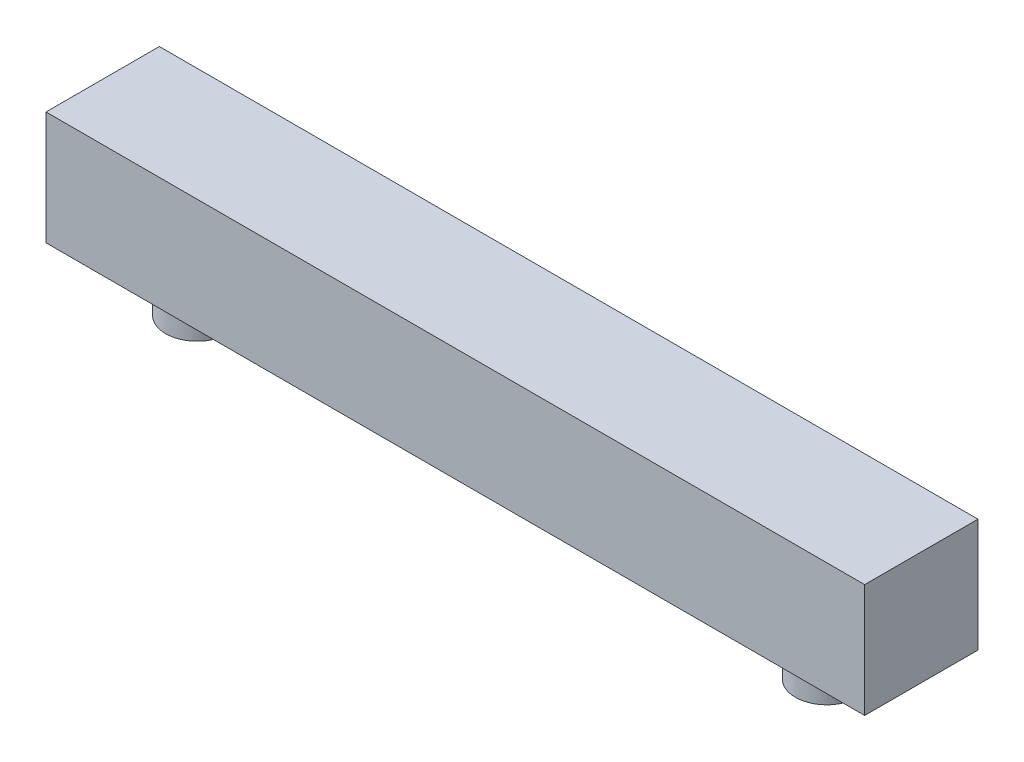
ISO-10303-21;
HEADER;
FILE_DESCRIPTION(('STEP AP214'),'2;1');
FILE_NAME('part.step','',(''),(''),'','','');
FILE_SCHEMA(('AUTOMOTIVE_DESIGN { 1 0 10303 214 1 1 1 1 }'));
ENDSEC;
DATA;
#1=APPLICATION_CONTEXT('core data for automotive mechanical design processes');
#2=APPLICATION_PROTOCOL_DEFINITION('international standard','automotive_design',2000,#1);
#3=PRODUCT_CONTEXT('',#1,'mechanical');
#4=PRODUCT('Part','Part','',(#3));
#5=PRODUCT_RELATED_PRODUCT_CATEGORY('part','',(#4));
#6=PRODUCT_DEFINITION_FORMATION('','',#4);
#7=PRODUCT_DEFINITION_CONTEXT('part definition',#1,'design');
#8=PRODUCT_DEFINITION('design','',#6,#7);
#9=PRODUCT_DEFINITION_SHAPE('','',#8);
#10=(LENGTH_UNIT() NAMED_UNIT(*) SI_UNIT(.MILLI.,.METRE.));
#11=(NAMED_UNIT(*) PLANE_ANGLE_UNIT() SI_UNIT($,.RADIAN.));
#12=(NAMED_UNIT(*) SI_UNIT($,.STERADIAN.) SOLID_ANGLE_UNIT());
#13=UNCERTAINTY_MEASURE_WITH_UNIT(LENGTH_MEASURE(1.E-05),#10,'distance_accuracy_value','');
#14=(GEOMETRIC_REPRESENTATION_CONTEXT(3) GLOBAL_UNCERTAINTY_ASSIGNED_CONTEXT((#13)) GLOBAL_UNIT_ASSIGNED_CONTEXT((#10,
#11,#12)) REPRESENTATION_CONTEXT('',''));
#15=CARTESIAN_POINT('',(0.,0.,0.));
#16=DIRECTION('',(0.,0.,1.));
#17=DIRECTION('',(1.,0.,0.));
#18=AXIS2_PLACEMENT_3D('',#15,#16,#17);
#19=CARTESIAN_POINT('',(0.,9.,0.));
#20=DIRECTION('',(1.,0.,0.));
#21=DIRECTION('',(0.,0.,-1.));
#22=AXIS2_PLACEMENT_3D('',#19,#20,#21);
#23=PLANE('',#22);
#24=DIRECTION('',(0.,0.,1.));
#25=VECTOR('',#24,1.);
#26=CARTESIAN_POINT('',(0.,0.,0.));
#27=LINE('',#26,#25);
#28=CARTESIAN_POINT('',(0.,0.,0.));
#29=VERTEX_POINT('',#28);
#30=CARTESIAN_POINT('',(0.,0.,9.));
#31=VERTEX_POINT('',#30);
#32=EDGE_CURVE('E99',#29,#31,#27,.T.);
#33=ORIENTED_EDGE('',*,*,#32,.T.);
#34=DIRECTION('',(0.,-1.,0.));
#35=VECTOR('',#34,1.);
#36=CARTESIAN_POINT('',(0.,9.,9.));
#37=LINE('',#36,#35);
#38=CARTESIAN_POINT('',(0.,9.,9.));
#39=VERTEX_POINT('',#38);
#40=EDGE_CURVE('E90',#39,#31,#37,.T.);
#41=ORIENTED_EDGE('',*,*,#40,.F.);
#42=DIRECTION('',(0.,0.,1.));
#43=VECTOR('',#42,1.);
#44=CARTESIAN_POINT('',(0.,9.,0.));
#45=LINE('',#44,#43);
#46=CARTESIAN_POINT('',(0.,9.,0.));
#47=VERTEX_POINT('',#46);
#48=EDGE_CURVE('E84',#47,#39,#45,.T.);
#49=ORIENTED_EDGE('',*,*,#48,.F.);
#50=DIRECTION('',(0.,-1.,0.));
#51=VECTOR('',#50,1.);
#52=CARTESIAN_POINT('',(0.,9.,0.));
#53=LINE('',#52,#51);
#54=EDGE_CURVE('E95',#47,#29,#53,.T.);
#55=ORIENTED_EDGE('',*,*,#54,.T.);
#56=EDGE_LOOP('',(#33,#41,#49,#55));
#57=FACE_BOUND('',#56,.T.);
#58=ADVANCED_FACE('F32',(#57),#23,.F.);
#59=CARTESIAN_POINT('',(0.,9.,9.));
#60=DIRECTION('',(0.,0.,-1.));
#61=DIRECTION('',(-1.,0.,0.));
#62=AXIS2_PLACEMENT_3D('',#59,#60,#61);
#63=PLANE('',#62);
#64=DIRECTION('',(1.,0.,0.));
#65=VECTOR('',#64,1.);
#66=CARTESIAN_POINT('',(0.,0.,9.));
#67=LINE('',#66,#65);
#68=CARTESIAN_POINT('',(65.,0.,9.));
#69=VERTEX_POINT('',#68);
#70=EDGE_CURVE('E89',#31,#69,#67,.T.);
#71=ORIENTED_EDGE('',*,*,#70,.T.);
#72=DIRECTION('',(0.,-1.,0.));
#73=VECTOR('',#72,1.);
#74=CARTESIAN_POINT('',(65.,9.,9.));
#75=LINE('',#74,#73);
#76=CARTESIAN_POINT('',(65.,9.,9.));
#77=VERTEX_POINT('',#76);
#78=EDGE_CURVE('E87',#77,#69,#75,.T.);
#79=ORIENTED_EDGE('',*,*,#78,.F.);
#80=DIRECTION('',(1.,0.,0.));
#81=VECTOR('',#80,1.);
#82=CARTESIAN_POINT('',(0.,9.,9.));
#83=LINE('',#82,#81);
#84=EDGE_CURVE('E79',#39,#77,#83,.T.);
#85=ORIENTED_EDGE('',*,*,#84,.F.);
#86=ORIENTED_EDGE('',*,*,#40,.T.);
#87=EDGE_LOOP('',(#71,#79,#85,#86));
#88=FACE_BOUND('',#87,.T.);
#89=ADVANCED_FACE('F88',(#88),#63,.F.);
#90=CARTESIAN_POINT('',(65.,9.,0.));
#91=DIRECTION('',(-1.,0.,0.));
#92=DIRECTION('',(0.,0.,1.));
#93=AXIS2_PLACEMENT_3D('',#90,#91,#92);
#94=PLANE('',#93);
#95=DIRECTION('',(0.,0.,-1.));
#96=VECTOR('',#95,1.);
#97=CARTESIAN_POINT('',(65.,0.,0.));
#98=LINE('',#97,#96);
#99=CARTESIAN_POINT('',(65.,0.,0.));
#100=VERTEX_POINT('',#99);
#101=EDGE_CURVE('E65',#69,#100,#98,.T.);
#102=ORIENTED_EDGE('',*,*,#101,.T.);
#103=DIRECTION('',(0.,-1.,0.));
#104=VECTOR('',#103,1.);
#105=CARTESIAN_POINT('',(65.,9.,0.));
#106=LINE('',#105,#104);
#107=CARTESIAN_POINT('',(65.,9.,0.));
#108=VERTEX_POINT('',#107);
#109=EDGE_CURVE('E91',#108,#100,#106,.T.);
#110=ORIENTED_EDGE('',*,*,#109,.F.);
#111=DIRECTION('',(0.,0.,-1.));
#112=VECTOR('',#111,1.);
#113=CARTESIAN_POINT('',(65.,9.,0.));
#114=LINE('',#113,#112);
#115=EDGE_CURVE('E82',#77,#108,#114,.T.);
#116=ORIENTED_EDGE('',*,*,#115,.F.);
#117=ORIENTED_EDGE('',*,*,#78,.T.);
#118=EDGE_LOOP('',(#102,#110,#116,#117));
#119=FACE_BOUND('',#118,.T.);
#120=ADVANCED_FACE('F93',(#119),#94,.F.);
#121=CARTESIAN_POINT('',(0.,9.,0.));
#122=DIRECTION('',(0.,0.,1.));
#123=DIRECTION('',(1.,0.,0.));
#124=AXIS2_PLACEMENT_3D('',#121,#122,#123);
#125=PLANE('',#124);
#126=DIRECTION('',(-1.,0.,0.));
#127=VECTOR('',#126,1.);
#128=CARTESIAN_POINT('',(0.,0.,0.));
#129=LINE('',#128,#127);
#130=EDGE_CURVE('E71',#100,#29,#129,.T.);
#131=ORIENTED_EDGE('',*,*,#130,.T.);
#132=ORIENTED_EDGE('',*,*,#54,.F.);
#133=DIRECTION('',(-1.,0.,0.));
#134=VECTOR('',#133,1.);
#135=CARTESIAN_POINT('',(0.,9.,0.));
#136=LINE('',#135,#134);
#137=EDGE_CURVE('E48',#108,#47,#136,.T.);
#138=ORIENTED_EDGE('',*,*,#137,.F.);
#139=ORIENTED_EDGE('',*,*,#109,.T.);
#140=EDGE_LOOP('',(#131,#132,#138,#139));
#141=FACE_BOUND('',#140,.T.);
#142=ADVANCED_FACE('F120',(#141),#125,.F.);
#143=CARTESIAN_POINT('',(0.,9.,0.));
#144=DIRECTION('',(0.,1.,0.));
#145=DIRECTION('',(0.,0.,1.));
#146=AXIS2_PLACEMENT_3D('',#143,#144,#145);
#147=PLANE('',#146);
#148=ORIENTED_EDGE('',*,*,#48,.T.);
#149=ORIENTED_EDGE('',*,*,#84,.T.);
#150=ORIENTED_EDGE('',*,*,#115,.T.);
#151=ORIENTED_EDGE('',*,*,#137,.T.);
#152=EDGE_LOOP('',(#148,#149,#150,#151));
#153=FACE_BOUND('',#152,.T.);
#154=ADVANCED_FACE('F80',(#153),#147,.T.);
#155=CARTESIAN_POINT('',(0.,0.,0.));
#156=DIRECTION('',(0.,1.,0.));
#157=DIRECTION('',(0.,0.,1.));
#158=AXIS2_PLACEMENT_3D('',#155,#156,#157);
#159=PLANE('',#158);
#160=CARTESIAN_POINT('',(57.5,0.,4.5));
#161=DIRECTION('',(0.,1.,0.));
#162=DIRECTION('',(0.,0.,1.));
#163=AXIS2_PLACEMENT_3D('',#160,#161,#162);
#164=CIRCLE('',#163,2.5);
#165=CARTESIAN_POINT('',(57.5,0.,7.));
#166=VERTEX_POINT('',#165);
#167=EDGE_CURVE('E11',#166,#166,#164,.F.);
#168=ORIENTED_EDGE('',*,*,#167,.F.);
#169=EDGE_LOOP('',(#168));
#170=FACE_BOUND('',#169,.T.);
#171=CARTESIAN_POINT('',(7.5,0.,4.5));
#172=DIRECTION('',(0.,1.,0.));
#173=DIRECTION('',(0.,0.,1.));
#174=AXIS2_PLACEMENT_3D('',#171,#172,#173);
#175=CIRCLE('',#174,2.5);
#176=CARTESIAN_POINT('',(7.5,0.,7.));
#177=VERTEX_POINT('',#176);
#178=EDGE_CURVE('E40',#177,#177,#175,.F.);
#179=ORIENTED_EDGE('',*,*,#178,.F.);
#180=EDGE_LOOP('',(#179));
#181=FACE_BOUND('',#180,.T.);
#182=ORIENTED_EDGE('',*,*,#32,.F.);
#183=ORIENTED_EDGE('',*,*,#130,.F.);
#184=ORIENTED_EDGE('',*,*,#101,.F.);
#185=ORIENTED_EDGE('',*,*,#70,.F.);
#186=EDGE_LOOP('',(#182,#183,#184,#185));
#187=FACE_BOUND('',#186,.T.);
#188=ADVANCED_FACE('F113',(#170,#181,#187),#159,.F.);
#189=CARTESIAN_POINT('',(7.5,-3.5,4.5));
#190=DIRECTION('',(0.,1.,0.));
#191=DIRECTION('',(0.,0.,1.));
#192=AXIS2_PLACEMENT_3D('',#189,#190,#191);
#193=CYLINDRICAL_SURFACE('',#192,2.5);
#194=CARTESIAN_POINT('',(7.5,-3.5,4.5));
#195=DIRECTION('',(0.,-1.,0.));
#196=DIRECTION('',(0.,0.,-1.));
#197=AXIS2_PLACEMENT_3D('',#194,#195,#196);
#198=CIRCLE('',#197,2.5);
#199=CARTESIAN_POINT('',(7.5,-3.5,2.));
#200=VERTEX_POINT('',#199);
#201=EDGE_CURVE('E102',#200,#200,#198,.T.);
#202=ORIENTED_EDGE('',*,*,#201,.F.);
#203=EDGE_LOOP('',(#202));
#204=FACE_BOUND('',#203,.T.);
#205=ORIENTED_EDGE('',*,*,#178,.T.);
#206=EDGE_LOOP('',(#205));
#207=FACE_BOUND('',#206,.T.);
#208=ADVANCED_FACE('F111',(#204,#207),#193,.T.);
#209=CARTESIAN_POINT('',(7.5,-3.5,4.5));
#210=DIRECTION('',(0.,-1.,0.));
#211=DIRECTION('',(0.,0.,-1.));
#212=AXIS2_PLACEMENT_3D('',#209,#210,#211);
#213=PLANE('',#212);
#214=ORIENTED_EDGE('',*,*,#201,.T.);
#215=EDGE_LOOP('',(#214));
#216=FACE_BOUND('',#215,.T.);
#217=ADVANCED_FACE('F164',(#216),#213,.T.);
#218=CARTESIAN_POINT('',(57.5,-3.5,4.5));
#219=DIRECTION('',(0.,1.,0.));
#220=DIRECTION('',(0.,0.,1.));
#221=AXIS2_PLACEMENT_3D('',#218,#219,#220);
#222=CYLINDRICAL_SURFACE('',#221,2.5);
#223=CARTESIAN_POINT('',(57.5,-3.5,4.5));
#224=DIRECTION('',(0.,-1.,0.));
#225=DIRECTION('',(0.,0.,1.));
#226=AXIS2_PLACEMENT_3D('',#223,#224,#225);
#227=CIRCLE('',#226,2.5);
#228=CARTESIAN_POINT('',(57.5,-3.5,7.));
#229=VERTEX_POINT('',#228);
#230=EDGE_CURVE('E200',#229,#229,#227,.T.);
#231=ORIENTED_EDGE('',*,*,#230,.F.);
#232=EDGE_LOOP('',(#231));
#233=FACE_BOUND('',#232,.T.);
#234=ORIENTED_EDGE('',*,*,#167,.T.);
#235=EDGE_LOOP('',(#234));
#236=FACE_BOUND('',#235,.T.);
#237=ADVANCED_FACE('F174',(#233,#236),#222,.T.);
#238=CARTESIAN_POINT('',(57.5,-3.5,4.5));
#239=DIRECTION('',(0.,1.,0.));
#240=DIRECTION('',(0.,0.,1.));
#241=AXIS2_PLACEMENT_3D('',#238,#239,#240);
#242=PLANE('',#241);
#243=ORIENTED_EDGE('',*,*,#230,.T.);
#244=EDGE_LOOP('',(#243));
#245=FACE_BOUND('',#244,.T.);
#246=ADVANCED_FACE('F184',(#245),#242,.F.);
#247=CLOSED_SHELL('',(#58,#89,#120,#142,#154,#188,#208,#217,#237,#246));
#248=MANIFOLD_SOLID_BREP('B2',#247);
#249=ADVANCED_BREP_SHAPE_REPRESENTATION('',(#18,#248),#14);
#250=SHAPE_DEFINITION_REPRESENTATION(#9,#249);
ENDSEC;
END-ISO-10303-21;
